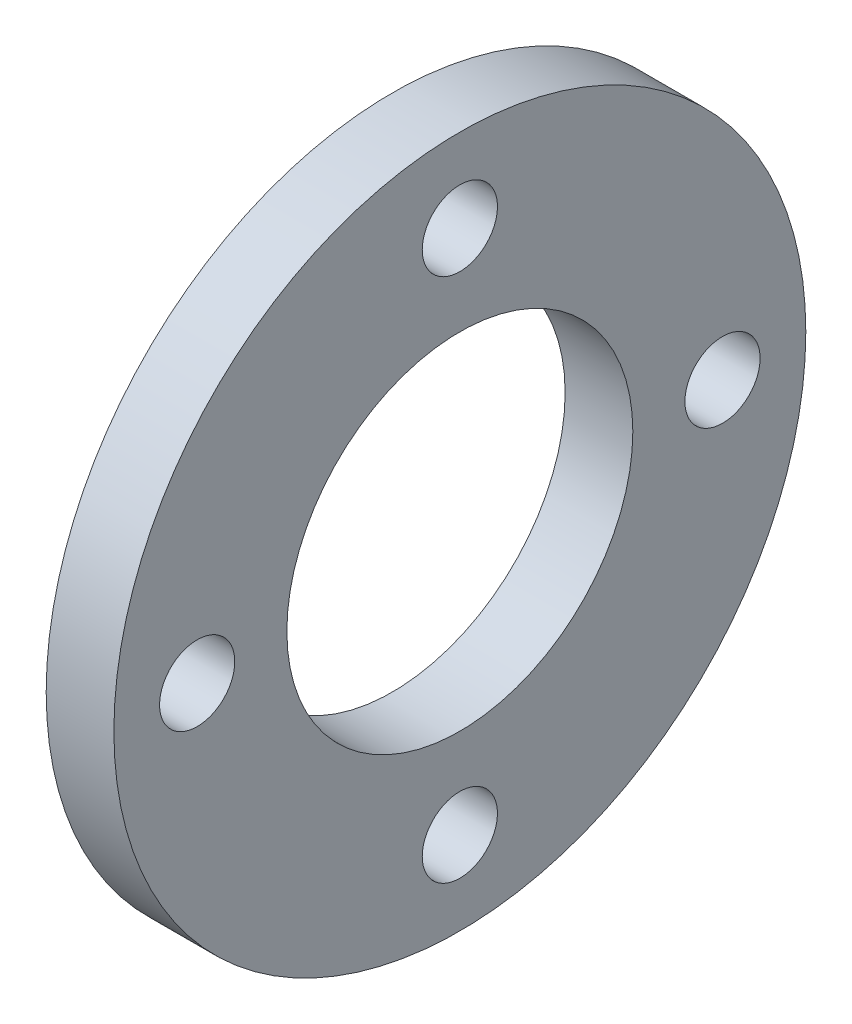
ISO-10303-21;
HEADER;
FILE_DESCRIPTION(('STEP AP214'),'2;1');
FILE_NAME('part.step','',(''),(''),'','','');
FILE_SCHEMA(('AUTOMOTIVE_DESIGN { 1 0 10303 214 1 1 1 1 }'));
ENDSEC;
DATA;
#1=APPLICATION_CONTEXT('core data for automotive mechanical design processes');
#2=APPLICATION_PROTOCOL_DEFINITION('international standard','automotive_design',2000,#1);
#3=PRODUCT_CONTEXT('',#1,'mechanical');
#4=PRODUCT('Part','Part','',(#3));
#5=PRODUCT_RELATED_PRODUCT_CATEGORY('part','',(#4));
#6=PRODUCT_DEFINITION_FORMATION('','',#4);
#7=PRODUCT_DEFINITION_CONTEXT('part definition',#1,'design');
#8=PRODUCT_DEFINITION('design','',#6,#7);
#9=PRODUCT_DEFINITION_SHAPE('','',#8);
#10=(LENGTH_UNIT() NAMED_UNIT(*) SI_UNIT(.MILLI.,.METRE.));
#11=(NAMED_UNIT(*) PLANE_ANGLE_UNIT() SI_UNIT($,.RADIAN.));
#12=(NAMED_UNIT(*) SI_UNIT($,.STERADIAN.) SOLID_ANGLE_UNIT());
#13=UNCERTAINTY_MEASURE_WITH_UNIT(LENGTH_MEASURE(1.E-05),#10,'distance_accuracy_value','');
#14=(GEOMETRIC_REPRESENTATION_CONTEXT(3) GLOBAL_UNCERTAINTY_ASSIGNED_CONTEXT((#13)) GLOBAL_UNIT_ASSIGNED_CONTEXT((#10,
#11,#12)) REPRESENTATION_CONTEXT('',''));
#15=CARTESIAN_POINT('',(0.,0.,0.));
#16=DIRECTION('',(0.,0.,1.));
#17=DIRECTION('',(1.,0.,0.));
#18=AXIS2_PLACEMENT_3D('',#15,#16,#17);
#19=CARTESIAN_POINT('',(18.,0.,69.85));
#20=DIRECTION('',(-1.,0.,0.));
#21=DIRECTION('',(0.,0.,1.));
#22=AXIS2_PLACEMENT_3D('',#19,#20,#21);
#23=CYLINDRICAL_SURFACE('',#22,10.);
#24=CARTESIAN_POINT('',(18.,0.,69.85));
#25=DIRECTION('',(-1.,0.,0.));
#26=DIRECTION('',(0.,0.,1.));
#27=AXIS2_PLACEMENT_3D('',#24,#25,#26);
#28=CIRCLE('',#27,10.);
#29=CARTESIAN_POINT('',(18.,0.,79.85));
#30=VERTEX_POINT('',#29);
#31=EDGE_CURVE('E39',#30,#30,#28,.T.);
#32=ORIENTED_EDGE('',*,*,#31,.F.);
#33=EDGE_LOOP('',(#32));
#34=FACE_BOUND('',#33,.T.);
#35=CARTESIAN_POINT('',(0.,0.,69.85));
#36=DIRECTION('',(-1.,0.,0.));
#37=DIRECTION('',(0.,0.,1.));
#38=AXIS2_PLACEMENT_3D('',#35,#36,#37);
#39=CIRCLE('',#38,10.);
#40=CARTESIAN_POINT('',(0.,0.,79.85));
#41=VERTEX_POINT('',#40);
#42=EDGE_CURVE('E16',#41,#41,#39,.F.);
#43=ORIENTED_EDGE('',*,*,#42,.F.);
#44=EDGE_LOOP('',(#43));
#45=FACE_BOUND('',#44,.T.);
#46=ADVANCED_FACE('F13',(#34,#45),#23,.F.);
#47=CARTESIAN_POINT('',(18.,-69.85,0.));
#48=DIRECTION('',(-1.,0.,0.));
#49=DIRECTION('',(0.,0.,1.));
#50=AXIS2_PLACEMENT_3D('',#47,#48,#49);
#51=CYLINDRICAL_SURFACE('',#50,10.);
#52=CARTESIAN_POINT('',(18.,-69.85,0.));
#53=DIRECTION('',(-1.,0.,0.));
#54=DIRECTION('',(0.,0.,1.));
#55=AXIS2_PLACEMENT_3D('',#52,#53,#54);
#56=CIRCLE('',#55,10.);
#57=CARTESIAN_POINT('',(18.,-69.85,10.));
#58=VERTEX_POINT('',#57);
#59=EDGE_CURVE('E36',#58,#58,#56,.T.);
#60=ORIENTED_EDGE('',*,*,#59,.F.);
#61=EDGE_LOOP('',(#60));
#62=FACE_BOUND('',#61,.T.);
#63=CARTESIAN_POINT('',(0.,-69.85,0.));
#64=DIRECTION('',(-1.,0.,0.));
#65=DIRECTION('',(0.,0.,1.));
#66=AXIS2_PLACEMENT_3D('',#63,#64,#65);
#67=CIRCLE('',#66,10.);
#68=CARTESIAN_POINT('',(0.,-69.85,10.));
#69=VERTEX_POINT('',#68);
#70=EDGE_CURVE('E50',#69,#69,#67,.F.);
#71=ORIENTED_EDGE('',*,*,#70,.F.);
#72=EDGE_LOOP('',(#71));
#73=FACE_BOUND('',#72,.T.);
#74=ADVANCED_FACE('F61',(#62,#73),#51,.F.);
#75=CARTESIAN_POINT('',(18.,0.,-69.85));
#76=DIRECTION('',(-1.,0.,0.));
#77=DIRECTION('',(0.,0.,1.));
#78=AXIS2_PLACEMENT_3D('',#75,#76,#77);
#79=CYLINDRICAL_SURFACE('',#78,10.);
#80=CARTESIAN_POINT('',(18.,0.,-69.85));
#81=DIRECTION('',(-1.,0.,0.));
#82=DIRECTION('',(0.,0.,1.));
#83=AXIS2_PLACEMENT_3D('',#80,#81,#82);
#84=CIRCLE('',#83,10.);
#85=CARTESIAN_POINT('',(18.,0.,-59.85));
#86=VERTEX_POINT('',#85);
#87=EDGE_CURVE('E33',#86,#86,#84,.T.);
#88=ORIENTED_EDGE('',*,*,#87,.F.);
#89=EDGE_LOOP('',(#88));
#90=FACE_BOUND('',#89,.T.);
#91=CARTESIAN_POINT('',(0.,0.,-69.85));
#92=DIRECTION('',(-1.,0.,0.));
#93=DIRECTION('',(0.,0.,1.));
#94=AXIS2_PLACEMENT_3D('',#91,#92,#93);
#95=CIRCLE('',#94,10.);
#96=CARTESIAN_POINT('',(0.,0.,-59.85));
#97=VERTEX_POINT('',#96);
#98=EDGE_CURVE('E48',#97,#97,#95,.F.);
#99=ORIENTED_EDGE('',*,*,#98,.F.);
#100=EDGE_LOOP('',(#99));
#101=FACE_BOUND('',#100,.T.);
#102=ADVANCED_FACE('F67',(#90,#101),#79,.F.);
#103=CARTESIAN_POINT('',(18.,69.85,0.));
#104=DIRECTION('',(-1.,0.,0.));
#105=DIRECTION('',(0.,0.,1.));
#106=AXIS2_PLACEMENT_3D('',#103,#104,#105);
#107=CYLINDRICAL_SURFACE('',#106,9.99999999999999);
#108=CARTESIAN_POINT('',(18.,69.85,0.));
#109=DIRECTION('',(-1.,0.,0.));
#110=DIRECTION('',(0.,0.,1.));
#111=AXIS2_PLACEMENT_3D('',#108,#109,#110);
#112=CIRCLE('',#111,9.99999999999999);
#113=CARTESIAN_POINT('',(18.,69.85,9.99999999999999));
#114=VERTEX_POINT('',#113);
#115=EDGE_CURVE('E30',#114,#114,#112,.T.);
#116=ORIENTED_EDGE('',*,*,#115,.F.);
#117=EDGE_LOOP('',(#116));
#118=FACE_BOUND('',#117,.T.);
#119=CARTESIAN_POINT('',(0.,69.85,0.));
#120=DIRECTION('',(-1.,0.,0.));
#121=DIRECTION('',(0.,0.,1.));
#122=AXIS2_PLACEMENT_3D('',#119,#120,#121);
#123=CIRCLE('',#122,9.99999999999999);
#124=CARTESIAN_POINT('',(0.,69.85,9.99999999999999));
#125=VERTEX_POINT('',#124);
#126=EDGE_CURVE('E45',#125,#125,#123,.F.);
#127=ORIENTED_EDGE('',*,*,#126,.F.);
#128=EDGE_LOOP('',(#127));
#129=FACE_BOUND('',#128,.T.);
#130=ADVANCED_FACE('F87',(#118,#129),#107,.F.);
#131=CARTESIAN_POINT('',(0.,0.,0.));
#132=DIRECTION('',(1.,0.,0.));
#133=DIRECTION('',(0.,0.,-1.));
#134=AXIS2_PLACEMENT_3D('',#131,#132,#133);
#135=CYLINDRICAL_SURFACE('',#134,46.);
#136=CARTESIAN_POINT('',(0.,0.,0.));
#137=DIRECTION('',(1.,0.,0.));
#138=DIRECTION('',(0.,0.,-1.));
#139=AXIS2_PLACEMENT_3D('',#136,#137,#138);
#140=CIRCLE('',#139,46.);
#141=CARTESIAN_POINT('',(0.,0.,-46.));
#142=VERTEX_POINT('',#141);
#143=EDGE_CURVE('E42',#142,#142,#140,.T.);
#144=ORIENTED_EDGE('',*,*,#143,.F.);
#145=EDGE_LOOP('',(#144));
#146=FACE_BOUND('',#145,.T.);
#147=CARTESIAN_POINT('',(18.,0.,0.));
#148=DIRECTION('',(1.,0.,0.));
#149=DIRECTION('',(0.,0.,-1.));
#150=AXIS2_PLACEMENT_3D('',#147,#148,#149);
#151=CIRCLE('',#150,46.);
#152=CARTESIAN_POINT('',(18.,0.,-46.));
#153=VERTEX_POINT('',#152);
#154=EDGE_CURVE('E25',#153,#153,#151,.F.);
#155=ORIENTED_EDGE('',*,*,#154,.F.);
#156=EDGE_LOOP('',(#155));
#157=FACE_BOUND('',#156,.T.);
#158=ADVANCED_FACE('F83',(#146,#157),#135,.F.);
#159=CARTESIAN_POINT('',(0.,-93.1040031625056,-92.));
#160=DIRECTION('',(-1.,0.,0.));
#161=DIRECTION('',(0.,0.,1.));
#162=AXIS2_PLACEMENT_3D('',#159,#160,#161);
#163=PLANE('',#162);
#164=ORIENTED_EDGE('',*,*,#143,.T.);
#165=EDGE_LOOP('',(#164));
#166=FACE_BOUND('',#165,.T.);
#167=ORIENTED_EDGE('',*,*,#126,.T.);
#168=EDGE_LOOP('',(#167));
#169=FACE_BOUND('',#168,.T.);
#170=ORIENTED_EDGE('',*,*,#98,.T.);
#171=EDGE_LOOP('',(#170));
#172=FACE_BOUND('',#171,.T.);
#173=ORIENTED_EDGE('',*,*,#70,.T.);
#174=EDGE_LOOP('',(#173));
#175=FACE_BOUND('',#174,.T.);
#176=ORIENTED_EDGE('',*,*,#42,.T.);
#177=EDGE_LOOP('',(#176));
#178=FACE_BOUND('',#177,.T.);
#179=CARTESIAN_POINT('',(0.,0.,0.));
#180=DIRECTION('',(1.,0.,0.));
#181=DIRECTION('',(0.,0.,-1.));
#182=AXIS2_PLACEMENT_3D('',#179,#180,#181);
#183=CIRCLE('',#182,92.);
#184=CARTESIAN_POINT('',(0.,0.,-92.));
#185=VERTEX_POINT('',#184);
#186=EDGE_CURVE('E20',#185,#185,#183,.T.);
#187=ORIENTED_EDGE('',*,*,#186,.F.);
#188=EDGE_LOOP('',(#187));
#189=FACE_BOUND('',#188,.T.);
#190=ADVANCED_FACE('F57',(#166,#169,#172,#175,#178,#189),#163,.T.);
#191=CARTESIAN_POINT('',(18.,-93.1040031625056,92.));
#192=DIRECTION('',(1.,0.,0.));
#193=DIRECTION('',(0.,0.,-1.));
#194=AXIS2_PLACEMENT_3D('',#191,#192,#193);
#195=PLANE('',#194);
#196=ORIENTED_EDGE('',*,*,#154,.T.);
#197=EDGE_LOOP('',(#196));
#198=FACE_BOUND('',#197,.T.);
#199=ORIENTED_EDGE('',*,*,#115,.T.);
#200=EDGE_LOOP('',(#199));
#201=FACE_BOUND('',#200,.T.);
#202=ORIENTED_EDGE('',*,*,#87,.T.);
#203=EDGE_LOOP('',(#202));
#204=FACE_BOUND('',#203,.T.);
#205=ORIENTED_EDGE('',*,*,#59,.T.);
#206=EDGE_LOOP('',(#205));
#207=FACE_BOUND('',#206,.T.);
#208=ORIENTED_EDGE('',*,*,#31,.T.);
#209=EDGE_LOOP('',(#208));
#210=FACE_BOUND('',#209,.T.);
#211=CARTESIAN_POINT('',(18.,0.,0.));
#212=DIRECTION('',(1.,0.,0.));
#213=DIRECTION('',(0.,0.,-1.));
#214=AXIS2_PLACEMENT_3D('',#211,#212,#213);
#215=CIRCLE('',#214,92.);
#216=CARTESIAN_POINT('',(18.,0.,-92.));
#217=VERTEX_POINT('',#216);
#218=EDGE_CURVE('E8',#217,#217,#215,.F.);
#219=ORIENTED_EDGE('',*,*,#218,.F.);
#220=EDGE_LOOP('',(#219));
#221=FACE_BOUND('',#220,.T.);
#222=ADVANCED_FACE('F72',(#198,#201,#204,#207,#210,#221),#195,.T.);
#223=CARTESIAN_POINT('',(18.,0.,0.));
#224=DIRECTION('',(1.,0.,0.));
#225=DIRECTION('',(0.,0.,-1.));
#226=AXIS2_PLACEMENT_3D('',#223,#224,#225);
#227=CYLINDRICAL_SURFACE('',#226,92.);
#228=ORIENTED_EDGE('',*,*,#186,.T.);
#229=EDGE_LOOP('',(#228));
#230=FACE_BOUND('',#229,.T.);
#231=ORIENTED_EDGE('',*,*,#218,.T.);
#232=EDGE_LOOP('',(#231));
#233=FACE_BOUND('',#232,.T.);
#234=ADVANCED_FACE('F70',(#230,#233),#227,.T.);
#235=CLOSED_SHELL('',(#46,#74,#102,#130,#158,#190,#222,#234));
#236=MANIFOLD_SOLID_BREP('B1',#235);
#237=ADVANCED_BREP_SHAPE_REPRESENTATION('',(#18,#236),#14);
#238=SHAPE_DEFINITION_REPRESENTATION(#9,#237);
ENDSEC;
END-ISO-10303-21;
